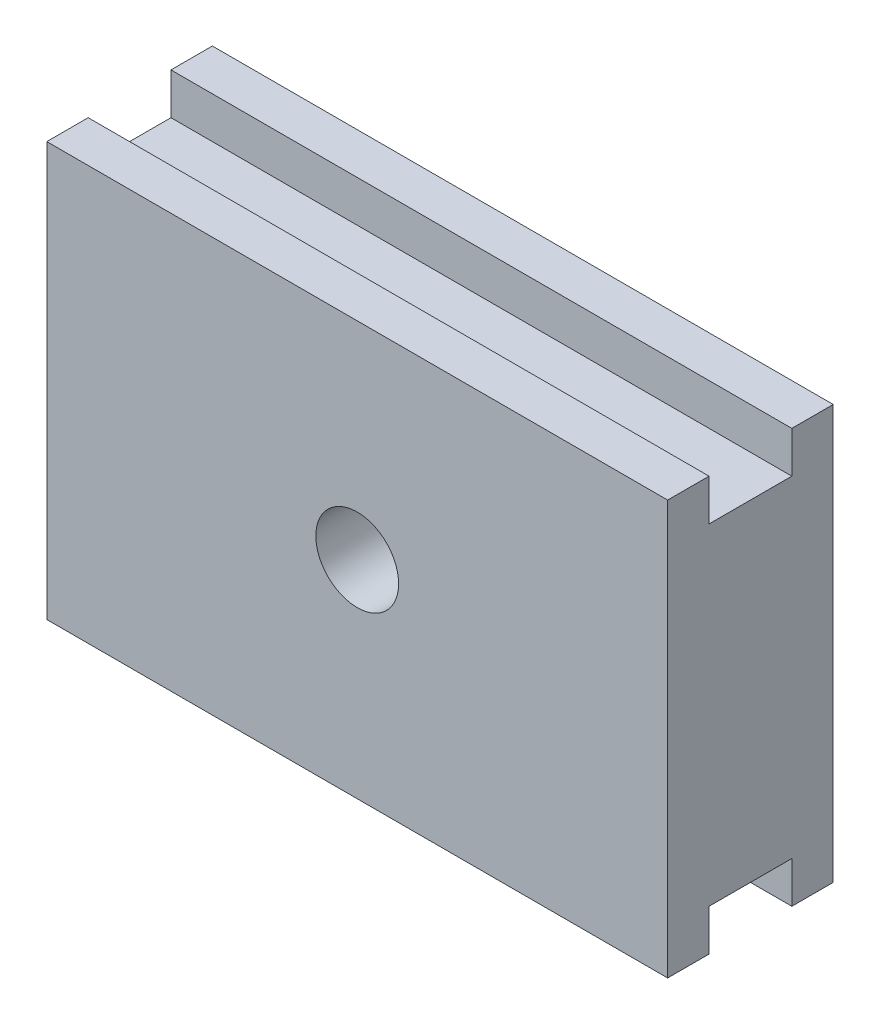
ISO-10303-21;
HEADER;
FILE_DESCRIPTION(('STEP AP214'),'2;1');
FILE_NAME('part.step','',(''),(''),'','','');
FILE_SCHEMA(('AUTOMOTIVE_DESIGN { 1 0 10303 214 1 1 1 1 }'));
ENDSEC;
DATA;
#1=APPLICATION_CONTEXT('core data for automotive mechanical design processes');
#2=APPLICATION_PROTOCOL_DEFINITION('international standard','automotive_design',2000,#1);
#3=PRODUCT_CONTEXT('',#1,'mechanical');
#4=PRODUCT('Part','Part','',(#3));
#5=PRODUCT_RELATED_PRODUCT_CATEGORY('part','',(#4));
#6=PRODUCT_DEFINITION_FORMATION('','',#4);
#7=PRODUCT_DEFINITION_CONTEXT('part definition',#1,'design');
#8=PRODUCT_DEFINITION('design','',#6,#7);
#9=PRODUCT_DEFINITION_SHAPE('','',#8);
#10=(LENGTH_UNIT() NAMED_UNIT(*) SI_UNIT(.MILLI.,.METRE.));
#11=(NAMED_UNIT(*) PLANE_ANGLE_UNIT() SI_UNIT($,.RADIAN.));
#12=(NAMED_UNIT(*) SI_UNIT($,.STERADIAN.) SOLID_ANGLE_UNIT());
#13=UNCERTAINTY_MEASURE_WITH_UNIT(LENGTH_MEASURE(1.E-05),#10,'distance_accuracy_value','');
#14=(GEOMETRIC_REPRESENTATION_CONTEXT(3) GLOBAL_UNCERTAINTY_ASSIGNED_CONTEXT((#13)) GLOBAL_UNIT_ASSIGNED_CONTEXT((#10,
#11,#12)) REPRESENTATION_CONTEXT('',''));
#15=CARTESIAN_POINT('',(0.,0.,0.));
#16=DIRECTION('',(0.,0.,1.));
#17=DIRECTION('',(1.,0.,0.));
#18=AXIS2_PLACEMENT_3D('',#15,#16,#17);
#19=CARTESIAN_POINT('',(-7.5,-5.,4.));
#20=DIRECTION('',(0.,1.,0.));
#21=DIRECTION('',(0.,0.,1.));
#22=AXIS2_PLACEMENT_3D('',#19,#20,#21);
#23=PLANE('',#22);
#24=DIRECTION('',(0.,0.,-1.));
#25=VECTOR('',#24,1.);
#26=CARTESIAN_POINT('',(-7.5,-5.,4.));
#27=LINE('',#26,#25);
#28=CARTESIAN_POINT('',(-7.5,-5.,4.));
#29=VERTEX_POINT('',#28);
#30=CARTESIAN_POINT('',(-7.5,-5.,3.));
#31=VERTEX_POINT('',#30);
#32=EDGE_CURVE('E137',#29,#31,#27,.T.);
#33=ORIENTED_EDGE('',*,*,#32,.T.);
#34=DIRECTION('',(1.,0.,0.));
#35=VECTOR('',#34,1.);
#36=CARTESIAN_POINT('',(-7.5,-5.,3.));
#37=LINE('',#36,#35);
#38=CARTESIAN_POINT('',(7.5,-5.,3.));
#39=VERTEX_POINT('',#38);
#40=EDGE_CURVE('E119',#31,#39,#37,.T.);
#41=ORIENTED_EDGE('',*,*,#40,.T.);
#42=DIRECTION('',(0.,0.,-1.));
#43=VECTOR('',#42,1.);
#44=CARTESIAN_POINT('',(7.5,-5.,4.));
#45=LINE('',#44,#43);
#46=CARTESIAN_POINT('',(7.5,-5.,4.));
#47=VERTEX_POINT('',#46);
#48=EDGE_CURVE('E147',#47,#39,#45,.T.);
#49=ORIENTED_EDGE('',*,*,#48,.F.);
#50=DIRECTION('',(1.,0.,0.));
#51=VECTOR('',#50,1.);
#52=CARTESIAN_POINT('',(-7.5,-5.,4.));
#53=LINE('',#52,#51);
#54=EDGE_CURVE('E142',#29,#47,#53,.T.);
#55=ORIENTED_EDGE('',*,*,#54,.F.);
#56=EDGE_LOOP('',(#33,#41,#49,#55));
#57=FACE_BOUND('',#56,.T.);
#58=ADVANCED_FACE('F30',(#57),#23,.F.);
#59=CARTESIAN_POINT('',(-7.5,5.,4.));
#60=DIRECTION('',(0.,-1.,0.));
#61=DIRECTION('',(0.,0.,-1.));
#62=AXIS2_PLACEMENT_3D('',#59,#60,#61);
#63=PLANE('',#62);
#64=DIRECTION('',(0.,0.,-1.));
#65=VECTOR('',#64,1.);
#66=CARTESIAN_POINT('',(-7.5,5.,4.));
#67=LINE('',#66,#65);
#68=CARTESIAN_POINT('',(-7.5,5.,1.));
#69=VERTEX_POINT('',#68);
#70=CARTESIAN_POINT('',(-7.5,5.,0.));
#71=VERTEX_POINT('',#70);
#72=EDGE_CURVE('E143',#69,#71,#67,.T.);
#73=ORIENTED_EDGE('',*,*,#72,.F.);
#74=DIRECTION('',(1.,0.,0.));
#75=VECTOR('',#74,1.);
#76=CARTESIAN_POINT('',(-7.5,5.,1.));
#77=LINE('',#76,#75);
#78=CARTESIAN_POINT('',(7.5,5.,1.));
#79=VERTEX_POINT('',#78);
#80=EDGE_CURVE('E162',#69,#79,#77,.T.);
#81=ORIENTED_EDGE('',*,*,#80,.T.);
#82=DIRECTION('',(0.,0.,-1.));
#83=VECTOR('',#82,1.);
#84=CARTESIAN_POINT('',(7.5,5.,4.));
#85=LINE('',#84,#83);
#86=CARTESIAN_POINT('',(7.5,5.,0.));
#87=VERTEX_POINT('',#86);
#88=EDGE_CURVE('E38',#79,#87,#85,.T.);
#89=ORIENTED_EDGE('',*,*,#88,.T.);
#90=DIRECTION('',(-1.,0.,0.));
#91=VECTOR('',#90,1.);
#92=CARTESIAN_POINT('',(-7.5,5.,0.));
#93=LINE('',#92,#91);
#94=EDGE_CURVE('E160',#87,#71,#93,.T.);
#95=ORIENTED_EDGE('',*,*,#94,.T.);
#96=EDGE_LOOP('',(#73,#81,#89,#95));
#97=FACE_BOUND('',#96,.T.);
#98=ADVANCED_FACE('F159',(#97),#63,.F.);
#99=CARTESIAN_POINT('',(7.5,5.,4.));
#100=DIRECTION('',(-1.,0.,0.));
#101=DIRECTION('',(0.,-1.,0.));
#102=AXIS2_PLACEMENT_3D('',#99,#100,#101);
#103=PLANE('',#102);
#104=ORIENTED_EDGE('',*,*,#48,.T.);
#105=DIRECTION('',(0.,-1.,0.));
#106=VECTOR('',#105,1.);
#107=CARTESIAN_POINT('',(7.5,-4.,3.));
#108=LINE('',#107,#106);
#109=CARTESIAN_POINT('',(7.5,-4.,3.));
#110=VERTEX_POINT('',#109);
#111=EDGE_CURVE('E125',#110,#39,#108,.T.);
#112=ORIENTED_EDGE('',*,*,#111,.F.);
#113=DIRECTION('',(0.,0.,1.));
#114=VECTOR('',#113,1.);
#115=CARTESIAN_POINT('',(7.5,-4.,0.999999999999999));
#116=LINE('',#115,#114);
#117=CARTESIAN_POINT('',(7.5,-4.,0.999999999999999));
#118=VERTEX_POINT('',#117);
#119=EDGE_CURVE('E140',#118,#110,#116,.T.);
#120=ORIENTED_EDGE('',*,*,#119,.F.);
#121=DIRECTION('',(0.,1.,0.));
#122=VECTOR('',#121,1.);
#123=CARTESIAN_POINT('',(7.5,-4.,0.999999999999999));
#124=LINE('',#123,#122);
#125=CARTESIAN_POINT('',(7.5,-5.,0.999999999999999));
#126=VERTEX_POINT('',#125);
#127=EDGE_CURVE('E350',#126,#118,#124,.T.);
#128=ORIENTED_EDGE('',*,*,#127,.F.);
#129=CARTESIAN_POINT('',(7.5,-5.,0.));
#130=VERTEX_POINT('',#129);
#131=EDGE_CURVE('E176',#126,#130,#45,.T.);
#132=ORIENTED_EDGE('',*,*,#131,.T.);
#133=DIRECTION('',(0.,1.,0.));
#134=VECTOR('',#133,1.);
#135=CARTESIAN_POINT('',(7.5,5.,0.));
#136=LINE('',#135,#134);
#137=EDGE_CURVE('E170',#130,#87,#136,.T.);
#138=ORIENTED_EDGE('',*,*,#137,.T.);
#139=ORIENTED_EDGE('',*,*,#88,.F.);
#140=DIRECTION('',(0.,1.,0.));
#141=VECTOR('',#140,1.);
#142=CARTESIAN_POINT('',(7.5,5.,1.));
#143=LINE('',#142,#141);
#144=CARTESIAN_POINT('',(7.5,4.,1.));
#145=VERTEX_POINT('',#144);
#146=EDGE_CURVE('E357',#145,#79,#143,.T.);
#147=ORIENTED_EDGE('',*,*,#146,.F.);
#148=DIRECTION('',(0.,0.,-1.));
#149=VECTOR('',#148,1.);
#150=CARTESIAN_POINT('',(7.5,4.,1.));
#151=LINE('',#150,#149);
#152=CARTESIAN_POINT('',(7.5,4.,3.));
#153=VERTEX_POINT('',#152);
#154=EDGE_CURVE('E365',#153,#145,#151,.T.);
#155=ORIENTED_EDGE('',*,*,#154,.F.);
#156=DIRECTION('',(0.,-1.,0.));
#157=VECTOR('',#156,1.);
#158=CARTESIAN_POINT('',(7.5,5.,3.));
#159=LINE('',#158,#157);
#160=CARTESIAN_POINT('',(7.5,5.,3.));
#161=VERTEX_POINT('',#160);
#162=EDGE_CURVE('E202',#161,#153,#159,.T.);
#163=ORIENTED_EDGE('',*,*,#162,.F.);
#164=CARTESIAN_POINT('',(7.5,5.,4.));
#165=VERTEX_POINT('',#164);
#166=EDGE_CURVE('E11',#165,#161,#85,.T.);
#167=ORIENTED_EDGE('',*,*,#166,.F.);
#168=DIRECTION('',(0.,1.,0.));
#169=VECTOR('',#168,1.);
#170=CARTESIAN_POINT('',(7.5,5.,4.));
#171=LINE('',#170,#169);
#172=EDGE_CURVE('E186',#47,#165,#171,.T.);
#173=ORIENTED_EDGE('',*,*,#172,.F.);
#174=EDGE_LOOP('',(#104,#112,#120,#128,#132,#138,#139,#147,#155,#163,#167,#173));
#175=FACE_BOUND('',#174,.T.);
#176=ADVANCED_FACE('F32',(#175),#103,.F.);
#177=ORIENTED_EDGE('',*,*,#166,.T.);
#178=DIRECTION('',(1.,0.,0.));
#179=VECTOR('',#178,1.);
#180=CARTESIAN_POINT('',(-7.5,5.,3.));
#181=LINE('',#180,#179);
#182=CARTESIAN_POINT('',(-7.5,5.,3.));
#183=VERTEX_POINT('',#182);
#184=EDGE_CURVE('E206',#183,#161,#181,.T.);
#185=ORIENTED_EDGE('',*,*,#184,.F.);
#186=CARTESIAN_POINT('',(-7.5,5.,4.));
#187=VERTEX_POINT('',#186);
#188=EDGE_CURVE('E146',#187,#183,#67,.T.);
#189=ORIENTED_EDGE('',*,*,#188,.F.);
#190=DIRECTION('',(-1.,0.,0.));
#191=VECTOR('',#190,1.);
#192=CARTESIAN_POINT('',(-7.5,5.,4.));
#193=LINE('',#192,#191);
#194=EDGE_CURVE('E189',#165,#187,#193,.T.);
#195=ORIENTED_EDGE('',*,*,#194,.F.);
#196=EDGE_LOOP('',(#177,#185,#189,#195));
#197=FACE_BOUND('',#196,.T.);
#198=ADVANCED_FACE('F205',(#197),#63,.F.);
#199=CARTESIAN_POINT('',(-7.5,5.,4.));
#200=DIRECTION('',(1.,0.,0.));
#201=DIRECTION('',(0.,1.,0.));
#202=AXIS2_PLACEMENT_3D('',#199,#200,#201);
#203=PLANE('',#202);
#204=DIRECTION('',(0.,0.,1.));
#205=VECTOR('',#204,1.);
#206=CARTESIAN_POINT('',(-7.5,-4.,0.999999999999999));
#207=LINE('',#206,#205);
#208=CARTESIAN_POINT('',(-7.5,-4.,0.999999999999999));
#209=VERTEX_POINT('',#208);
#210=CARTESIAN_POINT('',(-7.5,-4.,3.));
#211=VERTEX_POINT('',#210);
#212=EDGE_CURVE('E131',#209,#211,#207,.T.);
#213=ORIENTED_EDGE('',*,*,#212,.T.);
#214=DIRECTION('',(0.,-1.,0.));
#215=VECTOR('',#214,1.);
#216=CARTESIAN_POINT('',(-7.5,-4.,3.));
#217=LINE('',#216,#215);
#218=EDGE_CURVE('E122',#211,#31,#217,.T.);
#219=ORIENTED_EDGE('',*,*,#218,.T.);
#220=ORIENTED_EDGE('',*,*,#32,.F.);
#221=DIRECTION('',(0.,-1.,0.));
#222=VECTOR('',#221,1.);
#223=CARTESIAN_POINT('',(-7.5,5.,4.));
#224=LINE('',#223,#222);
#225=EDGE_CURVE('E194',#187,#29,#224,.T.);
#226=ORIENTED_EDGE('',*,*,#225,.F.);
#227=ORIENTED_EDGE('',*,*,#188,.T.);
#228=DIRECTION('',(0.,-1.,0.));
#229=VECTOR('',#228,1.);
#230=CARTESIAN_POINT('',(-7.5,5.,3.));
#231=LINE('',#230,#229);
#232=CARTESIAN_POINT('',(-7.5,4.,3.));
#233=VERTEX_POINT('',#232);
#234=EDGE_CURVE('E364',#183,#233,#231,.T.);
#235=ORIENTED_EDGE('',*,*,#234,.T.);
#236=DIRECTION('',(0.,0.,-1.));
#237=VECTOR('',#236,1.);
#238=CARTESIAN_POINT('',(-7.5,4.,1.));
#239=LINE('',#238,#237);
#240=CARTESIAN_POINT('',(-7.5,4.,1.));
#241=VERTEX_POINT('',#240);
#242=EDGE_CURVE('E53',#233,#241,#239,.T.);
#243=ORIENTED_EDGE('',*,*,#242,.T.);
#244=DIRECTION('',(0.,1.,0.));
#245=VECTOR('',#244,1.);
#246=CARTESIAN_POINT('',(-7.5,5.,1.));
#247=LINE('',#246,#245);
#248=EDGE_CURVE('E361',#241,#69,#247,.T.);
#249=ORIENTED_EDGE('',*,*,#248,.T.);
#250=ORIENTED_EDGE('',*,*,#72,.T.);
#251=DIRECTION('',(0.,-1.,0.));
#252=VECTOR('',#251,1.);
#253=CARTESIAN_POINT('',(-7.5,5.,0.));
#254=LINE('',#253,#252);
#255=CARTESIAN_POINT('',(-7.5,-5.,0.));
#256=VERTEX_POINT('',#255);
#257=EDGE_CURVE('E172',#71,#256,#254,.T.);
#258=ORIENTED_EDGE('',*,*,#257,.T.);
#259=CARTESIAN_POINT('',(-7.5,-5.,0.999999999999999));
#260=VERTEX_POINT('',#259);
#261=EDGE_CURVE('E144',#260,#256,#27,.T.);
#262=ORIENTED_EDGE('',*,*,#261,.F.);
#263=DIRECTION('',(0.,1.,0.));
#264=VECTOR('',#263,1.);
#265=CARTESIAN_POINT('',(-7.5,-4.,0.999999999999999));
#266=LINE('',#265,#264);
#267=EDGE_CURVE('E45',#260,#209,#266,.T.);
#268=ORIENTED_EDGE('',*,*,#267,.T.);
#269=EDGE_LOOP('',(#213,#219,#220,#226,#227,#235,#243,#249,#250,#258,#262,#268));
#270=FACE_BOUND('',#269,.T.);
#271=ADVANCED_FACE('F135',(#270),#203,.F.);
#272=ORIENTED_EDGE('',*,*,#131,.F.);
#273=DIRECTION('',(1.,0.,0.));
#274=VECTOR('',#273,1.);
#275=CARTESIAN_POINT('',(-7.5,-5.,0.999999999999999));
#276=LINE('',#275,#274);
#277=EDGE_CURVE('E130',#260,#126,#276,.T.);
#278=ORIENTED_EDGE('',*,*,#277,.F.);
#279=ORIENTED_EDGE('',*,*,#261,.T.);
#280=DIRECTION('',(1.,0.,0.));
#281=VECTOR('',#280,1.);
#282=CARTESIAN_POINT('',(-7.5,-5.,0.));
#283=LINE('',#282,#281);
#284=EDGE_CURVE('E185',#256,#130,#283,.T.);
#285=ORIENTED_EDGE('',*,*,#284,.T.);
#286=EDGE_LOOP('',(#272,#278,#279,#285));
#287=FACE_BOUND('',#286,.T.);
#288=ADVANCED_FACE('F209',(#287),#23,.F.);
#289=CARTESIAN_POINT('',(7.5,-5.,4.));
#290=DIRECTION('',(0.,0.,1.));
#291=DIRECTION('',(1.,0.,0.));
#292=AXIS2_PLACEMENT_3D('',#289,#290,#291);
#293=PLANE('',#292);
#294=CARTESIAN_POINT('',(0.,0.,4.));
#295=DIRECTION('',(0.,0.,1.));
#296=DIRECTION('',(1.,0.,0.));
#297=AXIS2_PLACEMENT_3D('',#294,#295,#296);
#298=CIRCLE('',#297,1.);
#299=CARTESIAN_POINT('',(1.,0.,4.));
#300=VERTEX_POINT('',#299);
#301=EDGE_CURVE('E343',#300,#300,#298,.T.);
#302=ORIENTED_EDGE('',*,*,#301,.F.);
#303=EDGE_LOOP('',(#302));
#304=FACE_BOUND('',#303,.T.);
#305=ORIENTED_EDGE('',*,*,#172,.T.);
#306=ORIENTED_EDGE('',*,*,#194,.T.);
#307=ORIENTED_EDGE('',*,*,#225,.T.);
#308=ORIENTED_EDGE('',*,*,#54,.T.);
#309=EDGE_LOOP('',(#305,#306,#307,#308));
#310=FACE_BOUND('',#309,.T.);
#311=ADVANCED_FACE('F207',(#304,#310),#293,.T.);
#312=CARTESIAN_POINT('',(7.5,-5.,0.));
#313=DIRECTION('',(0.,0.,1.));
#314=DIRECTION('',(1.,0.,0.));
#315=AXIS2_PLACEMENT_3D('',#312,#313,#314);
#316=PLANE('',#315);
#317=CARTESIAN_POINT('',(0.,0.,0.));
#318=DIRECTION('',(0.,0.,1.));
#319=DIRECTION('',(1.,0.,0.));
#320=AXIS2_PLACEMENT_3D('',#317,#318,#319);
#321=CIRCLE('',#320,1.);
#322=CARTESIAN_POINT('',(1.,0.,0.));
#323=VERTEX_POINT('',#322);
#324=EDGE_CURVE('E341',#323,#323,#321,.T.);
#325=ORIENTED_EDGE('',*,*,#324,.T.);
#326=EDGE_LOOP('',(#325));
#327=FACE_BOUND('',#326,.T.);
#328=ORIENTED_EDGE('',*,*,#137,.F.);
#329=ORIENTED_EDGE('',*,*,#284,.F.);
#330=ORIENTED_EDGE('',*,*,#257,.F.);
#331=ORIENTED_EDGE('',*,*,#94,.F.);
#332=EDGE_LOOP('',(#328,#329,#330,#331));
#333=FACE_BOUND('',#332,.T.);
#334=ADVANCED_FACE('F168',(#327,#333),#316,.F.);
#335=CARTESIAN_POINT('',(-7.5,5.,1.));
#336=DIRECTION('',(0.,0.,-1.));
#337=DIRECTION('',(0.,1.,0.));
#338=AXIS2_PLACEMENT_3D('',#335,#336,#337);
#339=PLANE('',#338);
#340=ORIENTED_EDGE('',*,*,#146,.T.);
#341=ORIENTED_EDGE('',*,*,#80,.F.);
#342=ORIENTED_EDGE('',*,*,#248,.F.);
#343=DIRECTION('',(1.,0.,0.));
#344=VECTOR('',#343,1.);
#345=CARTESIAN_POINT('',(-7.5,4.,1.));
#346=LINE('',#345,#344);
#347=EDGE_CURVE('E178',#241,#145,#346,.T.);
#348=ORIENTED_EDGE('',*,*,#347,.T.);
#349=EDGE_LOOP('',(#340,#341,#342,#348));
#350=FACE_BOUND('',#349,.T.);
#351=ADVANCED_FACE('F216',(#350),#339,.F.);
#352=CARTESIAN_POINT('',(-7.5,4.,1.));
#353=DIRECTION('',(0.,-1.,0.));
#354=DIRECTION('',(1.,0.,0.));
#355=AXIS2_PLACEMENT_3D('',#352,#353,#354);
#356=PLANE('',#355);
#357=ORIENTED_EDGE('',*,*,#154,.T.);
#358=ORIENTED_EDGE('',*,*,#347,.F.);
#359=ORIENTED_EDGE('',*,*,#242,.F.);
#360=DIRECTION('',(1.,0.,0.));
#361=VECTOR('',#360,1.);
#362=CARTESIAN_POINT('',(-7.5,4.,3.));
#363=LINE('',#362,#361);
#364=EDGE_CURVE('E180',#233,#153,#363,.T.);
#365=ORIENTED_EDGE('',*,*,#364,.T.);
#366=EDGE_LOOP('',(#357,#358,#359,#365));
#367=FACE_BOUND('',#366,.T.);
#368=ADVANCED_FACE('F254',(#367),#356,.F.);
#369=CARTESIAN_POINT('',(-7.5,5.,3.));
#370=DIRECTION('',(0.,0.,1.));
#371=DIRECTION('',(1.,0.,0.));
#372=AXIS2_PLACEMENT_3D('',#369,#370,#371);
#373=PLANE('',#372);
#374=ORIENTED_EDGE('',*,*,#162,.T.);
#375=ORIENTED_EDGE('',*,*,#364,.F.);
#376=ORIENTED_EDGE('',*,*,#234,.F.);
#377=ORIENTED_EDGE('',*,*,#184,.T.);
#378=EDGE_LOOP('',(#374,#375,#376,#377));
#379=FACE_BOUND('',#378,.T.);
#380=ADVANCED_FACE('F263',(#379),#373,.F.);
#381=CARTESIAN_POINT('',(-7.5,-4.,3.));
#382=DIRECTION('',(0.,0.,1.));
#383=DIRECTION('',(1.,0.,0.));
#384=AXIS2_PLACEMENT_3D('',#381,#382,#383);
#385=PLANE('',#384);
#386=ORIENTED_EDGE('',*,*,#111,.T.);
#387=ORIENTED_EDGE('',*,*,#40,.F.);
#388=ORIENTED_EDGE('',*,*,#218,.F.);
#389=DIRECTION('',(1.,0.,0.));
#390=VECTOR('',#389,1.);
#391=CARTESIAN_POINT('',(-7.5,-4.,3.));
#392=LINE('',#391,#390);
#393=EDGE_CURVE('E355',#211,#110,#392,.T.);
#394=ORIENTED_EDGE('',*,*,#393,.T.);
#395=EDGE_LOOP('',(#386,#387,#388,#394));
#396=FACE_BOUND('',#395,.T.);
#397=ADVANCED_FACE('F121',(#396),#385,.F.);
#398=CARTESIAN_POINT('',(-7.5,-4.,0.999999999999999));
#399=DIRECTION('',(0.,1.,0.));
#400=DIRECTION('',(-1.,0.,0.));
#401=AXIS2_PLACEMENT_3D('',#398,#399,#400);
#402=PLANE('',#401);
#403=ORIENTED_EDGE('',*,*,#119,.T.);
#404=ORIENTED_EDGE('',*,*,#393,.F.);
#405=ORIENTED_EDGE('',*,*,#212,.F.);
#406=DIRECTION('',(1.,0.,0.));
#407=VECTOR('',#406,1.);
#408=CARTESIAN_POINT('',(-7.5,-4.,0.999999999999999));
#409=LINE('',#408,#407);
#410=EDGE_CURVE('E358',#209,#118,#409,.T.);
#411=ORIENTED_EDGE('',*,*,#410,.T.);
#412=EDGE_LOOP('',(#403,#404,#405,#411));
#413=FACE_BOUND('',#412,.T.);
#414=ADVANCED_FACE('F279',(#413),#402,.F.);
#415=CARTESIAN_POINT('',(-7.5,-4.,0.999999999999999));
#416=DIRECTION('',(0.,0.,-1.));
#417=DIRECTION('',(0.,1.,0.));
#418=AXIS2_PLACEMENT_3D('',#415,#416,#417);
#419=PLANE('',#418);
#420=ORIENTED_EDGE('',*,*,#127,.T.);
#421=ORIENTED_EDGE('',*,*,#410,.F.);
#422=ORIENTED_EDGE('',*,*,#267,.F.);
#423=ORIENTED_EDGE('',*,*,#277,.T.);
#424=EDGE_LOOP('',(#420,#421,#422,#423));
#425=FACE_BOUND('',#424,.T.);
#426=ADVANCED_FACE('F287',(#425),#419,.F.);
#427=CARTESIAN_POINT('',(0.,0.,0.));
#428=DIRECTION('',(0.,0.,1.));
#429=DIRECTION('',(1.,0.,0.));
#430=AXIS2_PLACEMENT_3D('',#427,#428,#429);
#431=CYLINDRICAL_SURFACE('',#430,1.);
#432=ORIENTED_EDGE('',*,*,#324,.F.);
#433=EDGE_LOOP('',(#432));
#434=FACE_BOUND('',#433,.T.);
#435=ORIENTED_EDGE('',*,*,#301,.T.);
#436=EDGE_LOOP('',(#435));
#437=FACE_BOUND('',#436,.T.);
#438=ADVANCED_FACE('F295',(#434,#437),#431,.F.);
#439=CLOSED_SHELL('',(#58,#98,#176,#198,#271,#288,#311,#334,#351,#368,#380,#397,#414,#426,#438));
#440=MANIFOLD_SOLID_BREP('B2',#439);
#441=ADVANCED_BREP_SHAPE_REPRESENTATION('',(#18,#440),#14);
#442=SHAPE_DEFINITION_REPRESENTATION(#9,#441);
ENDSEC;
END-ISO-10303-21;
